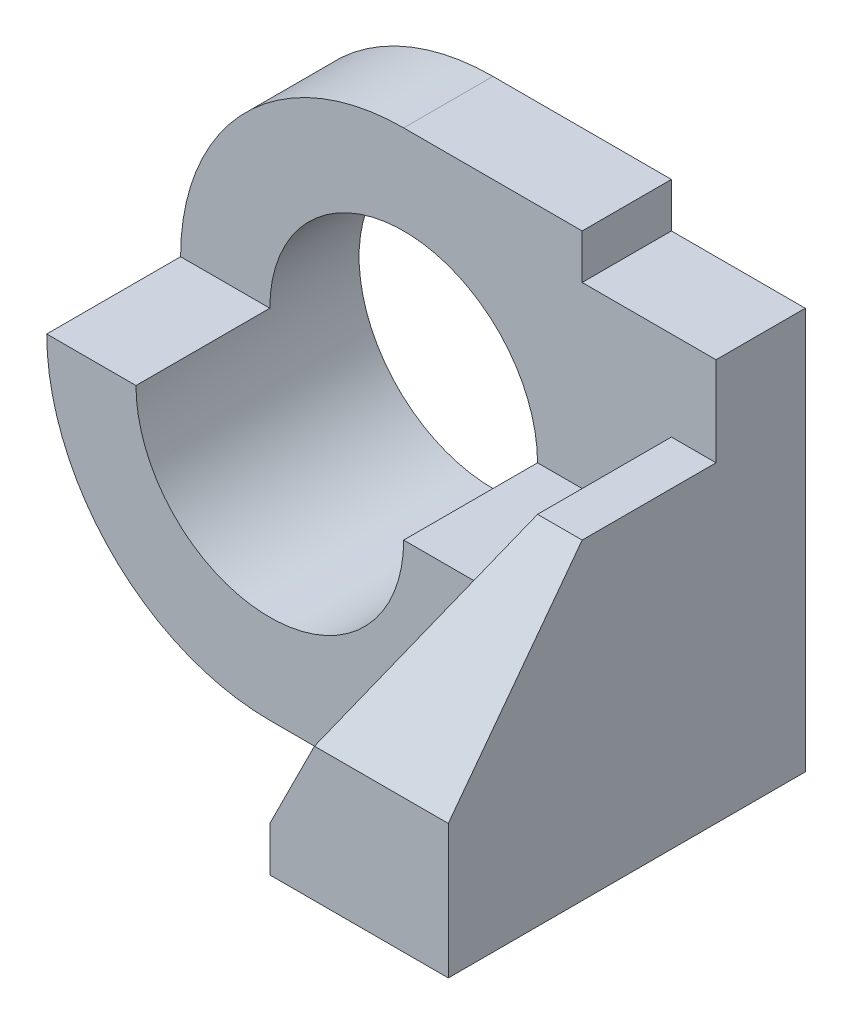
ISO-10303-21;
HEADER;
FILE_DESCRIPTION(('STEP AP214'),'2;1');
FILE_NAME('part.step','',(''),(''),'','','');
FILE_SCHEMA(('AUTOMOTIVE_DESIGN { 1 0 10303 214 1 1 1 1 }'));
ENDSEC;
DATA;
#1=APPLICATION_CONTEXT('core data for automotive mechanical design processes');
#2=APPLICATION_PROTOCOL_DEFINITION('international standard','automotive_design',2000,#1);
#3=PRODUCT_CONTEXT('',#1,'mechanical');
#4=PRODUCT('Part','Part','',(#3));
#5=PRODUCT_RELATED_PRODUCT_CATEGORY('part','',(#4));
#6=PRODUCT_DEFINITION_FORMATION('','',#4);
#7=PRODUCT_DEFINITION_CONTEXT('part definition',#1,'design');
#8=PRODUCT_DEFINITION('design','',#6,#7);
#9=PRODUCT_DEFINITION_SHAPE('','',#8);
#10=(LENGTH_UNIT() NAMED_UNIT(*) SI_UNIT(.MILLI.,.METRE.));
#11=(NAMED_UNIT(*) PLANE_ANGLE_UNIT() SI_UNIT($,.RADIAN.));
#12=(NAMED_UNIT(*) SI_UNIT($,.STERADIAN.) SOLID_ANGLE_UNIT());
#13=UNCERTAINTY_MEASURE_WITH_UNIT(LENGTH_MEASURE(1.E-05),#10,'distance_accuracy_value','');
#14=(GEOMETRIC_REPRESENTATION_CONTEXT(3) GLOBAL_UNCERTAINTY_ASSIGNED_CONTEXT((#13)) GLOBAL_UNIT_ASSIGNED_CONTEXT((#10,
#11,#12)) REPRESENTATION_CONTEXT('',''));
#15=CARTESIAN_POINT('',(0.,0.,0.));
#16=DIRECTION('',(0.,0.,1.));
#17=DIRECTION('',(1.,0.,0.));
#18=AXIS2_PLACEMENT_3D('',#15,#16,#17);
#19=CARTESIAN_POINT('',(0.,5.,5.));
#20=DIRECTION('',(0.,0.,1.));
#21=DIRECTION('',(1.,0.,0.));
#22=AXIS2_PLACEMENT_3D('',#19,#20,#21);
#23=PLANE('',#22);
#24=DIRECTION('',(0.,1.,0.));
#25=VECTOR('',#24,1.);
#26=CARTESIAN_POINT('',(3.,5.,5.));
#27=LINE('',#26,#25);
#28=CARTESIAN_POINT('',(3.,0.,5.));
#29=VERTEX_POINT('',#28);
#30=CARTESIAN_POINT('',(3.,1.,5.));
#31=VERTEX_POINT('',#30);
#32=EDGE_CURVE('E185',#29,#31,#27,.T.);
#33=ORIENTED_EDGE('',*,*,#32,.T.);
#34=DIRECTION('',(0.447213595499958,0.894427190999916,0.));
#35=VECTOR('',#34,1.);
#36=CARTESIAN_POINT('',(4.,3.,5.));
#37=LINE('',#36,#35);
#38=CARTESIAN_POINT('',(5.,5.,5.));
#39=VERTEX_POINT('',#38);
#40=EDGE_CURVE('E158',#31,#39,#37,.T.);
#41=ORIENTED_EDGE('',*,*,#40,.T.);
#42=DIRECTION('',(1.,0.,0.));
#43=VECTOR('',#42,1.);
#44=CARTESIAN_POINT('',(-5.,5.,5.));
#45=LINE('',#44,#43);
#46=CARTESIAN_POINT('',(3.,5.,5.));
#47=VERTEX_POINT('',#46);
#48=EDGE_CURVE('E187',#47,#39,#45,.T.);
#49=ORIENTED_EDGE('',*,*,#48,.F.);
#50=CARTESIAN_POINT('',(0.,5.,5.));
#51=DIRECTION('',(0.,0.,1.));
#52=DIRECTION('',(1.,0.,0.));
#53=AXIS2_PLACEMENT_3D('',#50,#51,#52);
#54=CIRCLE('',#53,3.);
#55=CARTESIAN_POINT('',(-3.,5.,5.));
#56=VERTEX_POINT('',#55);
#57=EDGE_CURVE('E211',#56,#47,#54,.T.);
#58=ORIENTED_EDGE('',*,*,#57,.F.);
#59=CARTESIAN_POINT('',(-5.,5.,5.));
#60=VERTEX_POINT('',#59);
#61=EDGE_CURVE('E192',#60,#56,#45,.T.);
#62=ORIENTED_EDGE('',*,*,#61,.F.);
#63=CARTESIAN_POINT('',(0.,5.,5.));
#64=DIRECTION('',(0.,0.,1.));
#65=DIRECTION('',(1.,0.,0.));
#66=AXIS2_PLACEMENT_3D('',#63,#64,#65);
#67=CIRCLE('',#66,5.);
#68=CARTESIAN_POINT('',(0.,0.,5.));
#69=VERTEX_POINT('',#68);
#70=EDGE_CURVE('E217',#60,#69,#67,.T.);
#71=ORIENTED_EDGE('',*,*,#70,.T.);
#72=DIRECTION('',(1.,0.,0.));
#73=VECTOR('',#72,1.);
#74=CARTESIAN_POINT('',(0.,0.,5.));
#75=LINE('',#74,#73);
#76=EDGE_CURVE('E219',#69,#29,#75,.T.);
#77=ORIENTED_EDGE('',*,*,#76,.T.);
#78=EDGE_LOOP('',(#33,#41,#49,#58,#62,#71,#77));
#79=FACE_BOUND('',#78,.T.);
#80=ADVANCED_FACE('F37',(#79),#23,.T.);
#81=CARTESIAN_POINT('',(-5.,5.,2.));
#82=DIRECTION('',(0.,-1.,0.));
#83=DIRECTION('',(0.,0.,-1.));
#84=AXIS2_PLACEMENT_3D('',#81,#82,#83);
#85=PLANE('',#84);
#86=DIRECTION('',(0.,0.,1.));
#87=VECTOR('',#86,1.);
#88=CARTESIAN_POINT('',(5.,5.,2.));
#89=LINE('',#88,#87);
#90=CARTESIAN_POINT('',(5.,5.,2.));
#91=VERTEX_POINT('',#90);
#92=EDGE_CURVE('E182',#91,#39,#89,.T.);
#93=ORIENTED_EDGE('',*,*,#92,.F.);
#94=DIRECTION('',(1.,0.,0.));
#95=VECTOR('',#94,1.);
#96=CARTESIAN_POINT('',(-5.,5.,2.));
#97=LINE('',#96,#95);
#98=CARTESIAN_POINT('',(3.,5.,2.));
#99=VERTEX_POINT('',#98);
#100=EDGE_CURVE('E191',#99,#91,#97,.T.);
#101=ORIENTED_EDGE('',*,*,#100,.F.);
#102=DIRECTION('',(0.,0.,-1.));
#103=VECTOR('',#102,1.);
#104=CARTESIAN_POINT('',(3.,5.,5.));
#105=LINE('',#104,#103);
#106=EDGE_CURVE('E253',#99,#47,#105,.F.);
#107=ORIENTED_EDGE('',*,*,#106,.T.);
#108=ORIENTED_EDGE('',*,*,#48,.T.);
#109=EDGE_LOOP('',(#93,#101,#107,#108));
#110=FACE_BOUND('',#109,.T.);
#111=ADVANCED_FACE('F278',(#110),#85,.F.);
#112=CARTESIAN_POINT('',(0.,0.,2.));
#113=DIRECTION('',(0.,0.,-1.));
#114=DIRECTION('',(-1.,0.,0.));
#115=AXIS2_PLACEMENT_3D('',#112,#113,#114);
#116=PLANE('',#115);
#117=DIRECTION('',(-1.,0.,0.));
#118=VECTOR('',#117,1.);
#119=CARTESIAN_POINT('',(7.,7.,2.));
#120=LINE('',#119,#118);
#121=CARTESIAN_POINT('',(7.,7.,2.));
#122=VERTEX_POINT('',#121);
#123=CARTESIAN_POINT('',(6.,7.,2.));
#124=VERTEX_POINT('',#123);
#125=EDGE_CURVE('E172',#122,#124,#120,.T.);
#126=ORIENTED_EDGE('',*,*,#125,.F.);
#127=DIRECTION('',(0.,-1.,0.));
#128=VECTOR('',#127,1.);
#129=CARTESIAN_POINT('',(7.,0.,2.));
#130=LINE('',#129,#128);
#131=CARTESIAN_POINT('',(7.,9.,2.));
#132=VERTEX_POINT('',#131);
#133=EDGE_CURVE('E204',#132,#122,#130,.T.);
#134=ORIENTED_EDGE('',*,*,#133,.F.);
#135=DIRECTION('',(1.,0.,0.));
#136=VECTOR('',#135,1.);
#137=CARTESIAN_POINT('',(7.,9.,2.));
#138=LINE('',#137,#136);
#139=CARTESIAN_POINT('',(4.,9.,2.));
#140=VERTEX_POINT('',#139);
#141=EDGE_CURVE('E201',#140,#132,#138,.T.);
#142=ORIENTED_EDGE('',*,*,#141,.F.);
#143=DIRECTION('',(0.,-1.,0.));
#144=VECTOR('',#143,1.);
#145=CARTESIAN_POINT('',(4.,9.,2.));
#146=LINE('',#145,#144);
#147=CARTESIAN_POINT('',(4.,10.,2.));
#148=VERTEX_POINT('',#147);
#149=EDGE_CURVE('E198',#148,#140,#146,.T.);
#150=ORIENTED_EDGE('',*,*,#149,.F.);
#151=DIRECTION('',(1.,0.,0.));
#152=VECTOR('',#151,1.);
#153=CARTESIAN_POINT('',(4.,10.,2.));
#154=LINE('',#153,#152);
#155=CARTESIAN_POINT('',(0.,10.,2.));
#156=VERTEX_POINT('',#155);
#157=EDGE_CURVE('E195',#156,#148,#154,.T.);
#158=ORIENTED_EDGE('',*,*,#157,.F.);
#159=CARTESIAN_POINT('',(0.,5.,2.));
#160=DIRECTION('',(0.,0.,-1.));
#161=DIRECTION('',(-1.,0.,0.));
#162=AXIS2_PLACEMENT_3D('',#159,#160,#161);
#163=CIRCLE('',#162,5.);
#164=CARTESIAN_POINT('',(-5.,5.,2.));
#165=VERTEX_POINT('',#164);
#166=EDGE_CURVE('E207',#165,#156,#163,.T.);
#167=ORIENTED_EDGE('',*,*,#166,.F.);
#168=CARTESIAN_POINT('',(-3.,5.,2.));
#169=VERTEX_POINT('',#168);
#170=EDGE_CURVE('E188',#165,#169,#97,.T.);
#171=ORIENTED_EDGE('',*,*,#170,.T.);
#172=CARTESIAN_POINT('',(0.,5.,2.));
#173=DIRECTION('',(0.,0.,-1.));
#174=DIRECTION('',(-1.,0.,0.));
#175=AXIS2_PLACEMENT_3D('',#172,#173,#174);
#176=CIRCLE('',#175,3.);
#177=EDGE_CURVE('E251',#169,#99,#176,.T.);
#178=ORIENTED_EDGE('',*,*,#177,.T.);
#179=ORIENTED_EDGE('',*,*,#100,.T.);
#180=DIRECTION('',(-0.447213595499958,-0.894427190999916,0.));
#181=VECTOR('',#180,1.);
#182=CARTESIAN_POINT('',(6.,7.,2.));
#183=LINE('',#182,#181);
#184=EDGE_CURVE('E175',#124,#91,#183,.T.);
#185=ORIENTED_EDGE('',*,*,#184,.F.);
#186=EDGE_LOOP('',(#126,#134,#142,#150,#158,#167,#171,#178,#179,#185));
#187=FACE_BOUND('',#186,.T.);
#188=ADVANCED_FACE('F274',(#187),#116,.F.);
#189=CARTESIAN_POINT('',(0.,5.,0.));
#190=DIRECTION('',(0.,0.,1.));
#191=DIRECTION('',(1.,0.,0.));
#192=AXIS2_PLACEMENT_3D('',#189,#190,#191);
#193=PLANE('',#192);
#194=CARTESIAN_POINT('',(0.,5.,0.));
#195=DIRECTION('',(0.,0.,1.));
#196=DIRECTION('',(1.,0.,0.));
#197=AXIS2_PLACEMENT_3D('',#194,#195,#196);
#198=CIRCLE('',#197,5.);
#199=CARTESIAN_POINT('',(0.,10.,0.));
#200=VERTEX_POINT('',#199);
#201=CARTESIAN_POINT('',(0.,0.,0.));
#202=VERTEX_POINT('',#201);
#203=EDGE_CURVE('E214',#200,#202,#198,.T.);
#204=ORIENTED_EDGE('',*,*,#203,.F.);
#205=DIRECTION('',(-1.,0.,0.));
#206=VECTOR('',#205,1.);
#207=CARTESIAN_POINT('',(4.,10.,0.));
#208=LINE('',#207,#206);
#209=CARTESIAN_POINT('',(4.,10.,0.));
#210=VERTEX_POINT('',#209);
#211=EDGE_CURVE('E220',#210,#200,#208,.T.);
#212=ORIENTED_EDGE('',*,*,#211,.F.);
#213=DIRECTION('',(0.,1.,0.));
#214=VECTOR('',#213,1.);
#215=CARTESIAN_POINT('',(4.,9.,0.));
#216=LINE('',#215,#214);
#217=CARTESIAN_POINT('',(4.,9.,0.));
#218=VERTEX_POINT('',#217);
#219=EDGE_CURVE('E234',#218,#210,#216,.T.);
#220=ORIENTED_EDGE('',*,*,#219,.F.);
#221=DIRECTION('',(-1.,0.,0.));
#222=VECTOR('',#221,1.);
#223=CARTESIAN_POINT('',(7.,9.,0.));
#224=LINE('',#223,#222);
#225=CARTESIAN_POINT('',(7.,9.,0.));
#226=VERTEX_POINT('',#225);
#227=EDGE_CURVE('E231',#226,#218,#224,.T.);
#228=ORIENTED_EDGE('',*,*,#227,.F.);
#229=DIRECTION('',(0.,1.,0.));
#230=VECTOR('',#229,1.);
#231=CARTESIAN_POINT('',(7.,0.,0.));
#232=LINE('',#231,#230);
#233=CARTESIAN_POINT('',(7.,0.,0.));
#234=VERTEX_POINT('',#233);
#235=EDGE_CURVE('E228',#234,#226,#232,.T.);
#236=ORIENTED_EDGE('',*,*,#235,.F.);
#237=DIRECTION('',(1.,0.,0.));
#238=VECTOR('',#237,1.);
#239=CARTESIAN_POINT('',(0.,0.,0.));
#240=LINE('',#239,#238);
#241=EDGE_CURVE('E225',#202,#234,#240,.T.);
#242=ORIENTED_EDGE('',*,*,#241,.F.);
#243=EDGE_LOOP('',(#204,#212,#220,#228,#236,#242));
#244=FACE_BOUND('',#243,.T.);
#245=CARTESIAN_POINT('',(0.,5.,0.));
#246=DIRECTION('',(0.,0.,1.));
#247=DIRECTION('',(1.,0.,0.));
#248=AXIS2_PLACEMENT_3D('',#245,#246,#247);
#249=CIRCLE('',#248,3.);
#250=CARTESIAN_POINT('',(3.,5.,0.));
#251=VERTEX_POINT('',#250);
#252=EDGE_CURVE('E210',#251,#251,#249,.T.);
#253=ORIENTED_EDGE('',*,*,#252,.T.);
#254=EDGE_LOOP('',(#253));
#255=FACE_BOUND('',#254,.T.);
#256=ADVANCED_FACE('F302',(#244,#255),#193,.F.);
#257=CARTESIAN_POINT('',(0.,5.,5.));
#258=DIRECTION('',(0.,0.,-1.));
#259=DIRECTION('',(-1.,0.,0.));
#260=AXIS2_PLACEMENT_3D('',#257,#258,#259);
#261=CYLINDRICAL_SURFACE('',#260,5.);
#262=ORIENTED_EDGE('',*,*,#70,.F.);
#263=DIRECTION('',(0.,0.,1.));
#264=VECTOR('',#263,1.);
#265=CARTESIAN_POINT('',(-5.,5.,2.));
#266=LINE('',#265,#264);
#267=EDGE_CURVE('E190',#165,#60,#266,.T.);
#268=ORIENTED_EDGE('',*,*,#267,.F.);
#269=ORIENTED_EDGE('',*,*,#166,.T.);
#270=DIRECTION('',(0.,0.,-1.));
#271=VECTOR('',#270,1.);
#272=CARTESIAN_POINT('',(0.,10.,5.));
#273=LINE('',#272,#271);
#274=EDGE_CURVE('E222',#156,#200,#273,.T.);
#275=ORIENTED_EDGE('',*,*,#274,.T.);
#276=ORIENTED_EDGE('',*,*,#203,.T.);
#277=DIRECTION('',(0.,0.,-1.));
#278=VECTOR('',#277,1.);
#279=CARTESIAN_POINT('',(0.,0.,5.));
#280=LINE('',#279,#278);
#281=EDGE_CURVE('E248',#69,#202,#280,.T.);
#282=ORIENTED_EDGE('',*,*,#281,.F.);
#283=EDGE_LOOP('',(#262,#268,#269,#275,#276,#282));
#284=FACE_BOUND('',#283,.T.);
#285=ADVANCED_FACE('F305',(#284),#261,.T.);
#286=CARTESIAN_POINT('',(0.,0.,5.));
#287=DIRECTION('',(0.,1.,0.));
#288=DIRECTION('',(0.,0.,1.));
#289=AXIS2_PLACEMENT_3D('',#286,#287,#288);
#290=PLANE('',#289);
#291=DIRECTION('',(0.,0.,-1.));
#292=VECTOR('',#291,1.);
#293=CARTESIAN_POINT('',(7.,0.,5.));
#294=LINE('',#293,#292);
#295=CARTESIAN_POINT('',(7.,0.,8.));
#296=VERTEX_POINT('',#295);
#297=EDGE_CURVE('E246',#296,#234,#294,.T.);
#298=ORIENTED_EDGE('',*,*,#297,.F.);
#299=DIRECTION('',(1.,0.,0.));
#300=VECTOR('',#299,1.);
#301=CARTESIAN_POINT('',(3.,0.,8.));
#302=LINE('',#301,#300);
#303=CARTESIAN_POINT('',(3.,0.,8.));
#304=VERTEX_POINT('',#303);
#305=EDGE_CURVE('E167',#304,#296,#302,.T.);
#306=ORIENTED_EDGE('',*,*,#305,.F.);
#307=DIRECTION('',(0.,0.,-1.));
#308=VECTOR('',#307,1.);
#309=CARTESIAN_POINT('',(3.,0.,8.));
#310=LINE('',#309,#308);
#311=EDGE_CURVE('E162',#304,#29,#310,.T.);
#312=ORIENTED_EDGE('',*,*,#311,.T.);
#313=ORIENTED_EDGE('',*,*,#76,.F.);
#314=ORIENTED_EDGE('',*,*,#281,.T.);
#315=ORIENTED_EDGE('',*,*,#241,.T.);
#316=EDGE_LOOP('',(#298,#306,#312,#313,#314,#315));
#317=FACE_BOUND('',#316,.T.);
#318=ADVANCED_FACE('F321',(#317),#290,.F.);
#319=CARTESIAN_POINT('',(7.,0.,5.));
#320=DIRECTION('',(-1.,0.,0.));
#321=DIRECTION('',(0.,0.,1.));
#322=AXIS2_PLACEMENT_3D('',#319,#320,#321);
#323=PLANE('',#322);
#324=DIRECTION('',(0.,0.,-1.));
#325=VECTOR('',#324,1.);
#326=CARTESIAN_POINT('',(7.,7.,8.));
#327=LINE('',#326,#325);
#328=CARTESIAN_POINT('',(7.,7.,5.));
#329=VERTEX_POINT('',#328);
#330=EDGE_CURVE('E180',#329,#122,#327,.T.);
#331=ORIENTED_EDGE('',*,*,#330,.F.);
#332=DIRECTION('',(0.,-0.8,0.6));
#333=VECTOR('',#332,1.);
#334=CARTESIAN_POINT('',(7.,3.,8.));
#335=LINE('',#334,#333);
#336=CARTESIAN_POINT('',(7.,3.,8.));
#337=VERTEX_POINT('',#336);
#338=EDGE_CURVE('E13',#329,#337,#335,.T.);
#339=ORIENTED_EDGE('',*,*,#338,.T.);
#340=DIRECTION('',(0.,1.,0.));
#341=VECTOR('',#340,1.);
#342=CARTESIAN_POINT('',(7.,0.,8.));
#343=LINE('',#342,#341);
#344=EDGE_CURVE('E151',#296,#337,#343,.T.);
#345=ORIENTED_EDGE('',*,*,#344,.F.);
#346=ORIENTED_EDGE('',*,*,#297,.T.);
#347=ORIENTED_EDGE('',*,*,#235,.T.);
#348=DIRECTION('',(0.,0.,-1.));
#349=VECTOR('',#348,1.);
#350=CARTESIAN_POINT('',(7.,9.,5.));
#351=LINE('',#350,#349);
#352=EDGE_CURVE('E244',#132,#226,#351,.T.);
#353=ORIENTED_EDGE('',*,*,#352,.F.);
#354=ORIENTED_EDGE('',*,*,#133,.T.);
#355=EDGE_LOOP('',(#331,#339,#345,#346,#347,#353,#354));
#356=FACE_BOUND('',#355,.T.);
#357=ADVANCED_FACE('F284',(#356),#323,.F.);
#358=CARTESIAN_POINT('',(7.,9.,5.));
#359=DIRECTION('',(0.,-1.,0.));
#360=DIRECTION('',(0.,0.,-1.));
#361=AXIS2_PLACEMENT_3D('',#358,#359,#360);
#362=PLANE('',#361);
#363=DIRECTION('',(0.,0.,-1.));
#364=VECTOR('',#363,1.);
#365=CARTESIAN_POINT('',(4.,9.,5.));
#366=LINE('',#365,#364);
#367=EDGE_CURVE('E242',#140,#218,#366,.T.);
#368=ORIENTED_EDGE('',*,*,#367,.F.);
#369=ORIENTED_EDGE('',*,*,#141,.T.);
#370=ORIENTED_EDGE('',*,*,#352,.T.);
#371=ORIENTED_EDGE('',*,*,#227,.T.);
#372=EDGE_LOOP('',(#368,#369,#370,#371));
#373=FACE_BOUND('',#372,.T.);
#374=ADVANCED_FACE('F314',(#373),#362,.F.);
#375=CARTESIAN_POINT('',(4.,9.,5.));
#376=DIRECTION('',(-1.,0.,0.));
#377=DIRECTION('',(0.,0.,1.));
#378=AXIS2_PLACEMENT_3D('',#375,#376,#377);
#379=PLANE('',#378);
#380=DIRECTION('',(0.,0.,-1.));
#381=VECTOR('',#380,1.);
#382=CARTESIAN_POINT('',(4.,10.,5.));
#383=LINE('',#382,#381);
#384=EDGE_CURVE('E240',#148,#210,#383,.T.);
#385=ORIENTED_EDGE('',*,*,#384,.F.);
#386=ORIENTED_EDGE('',*,*,#149,.T.);
#387=ORIENTED_EDGE('',*,*,#367,.T.);
#388=ORIENTED_EDGE('',*,*,#219,.T.);
#389=EDGE_LOOP('',(#385,#386,#387,#388));
#390=FACE_BOUND('',#389,.T.);
#391=ADVANCED_FACE('F310',(#390),#379,.F.);
#392=CARTESIAN_POINT('',(4.,10.,5.));
#393=DIRECTION('',(0.,-1.,0.));
#394=DIRECTION('',(0.,0.,-1.));
#395=AXIS2_PLACEMENT_3D('',#392,#393,#394);
#396=PLANE('',#395);
#397=ORIENTED_EDGE('',*,*,#274,.F.);
#398=ORIENTED_EDGE('',*,*,#157,.T.);
#399=ORIENTED_EDGE('',*,*,#384,.T.);
#400=ORIENTED_EDGE('',*,*,#211,.T.);
#401=EDGE_LOOP('',(#397,#398,#399,#400));
#402=FACE_BOUND('',#401,.T.);
#403=ADVANCED_FACE('F307',(#402),#396,.F.);
#404=CARTESIAN_POINT('',(0.,5.,5.));
#405=DIRECTION('',(0.,0.,-1.));
#406=DIRECTION('',(-1.,0.,0.));
#407=AXIS2_PLACEMENT_3D('',#404,#405,#406);
#408=CYLINDRICAL_SURFACE('',#407,3.);
#409=DIRECTION('',(0.,0.,-1.));
#410=VECTOR('',#409,1.);
#411=CARTESIAN_POINT('',(-3.,5.,5.));
#412=LINE('',#411,#410);
#413=EDGE_CURVE('E255',#56,#169,#412,.T.);
#414=ORIENTED_EDGE('',*,*,#413,.F.);
#415=ORIENTED_EDGE('',*,*,#57,.T.);
#416=ORIENTED_EDGE('',*,*,#106,.F.);
#417=ORIENTED_EDGE('',*,*,#177,.F.);
#418=EDGE_LOOP('',(#414,#415,#416,#417));
#419=FACE_BOUND('',#418,.T.);
#420=ORIENTED_EDGE('',*,*,#252,.F.);
#421=EDGE_LOOP('',(#420));
#422=FACE_BOUND('',#421,.T.);
#423=ADVANCED_FACE('F269',(#419,#422),#408,.F.);
#424=ORIENTED_EDGE('',*,*,#413,.T.);
#425=ORIENTED_EDGE('',*,*,#170,.F.);
#426=ORIENTED_EDGE('',*,*,#267,.T.);
#427=ORIENTED_EDGE('',*,*,#61,.T.);
#428=EDGE_LOOP('',(#424,#425,#426,#427));
#429=FACE_BOUND('',#428,.T.);
#430=ADVANCED_FACE('F263',(#429),#85,.F.);
#431=CARTESIAN_POINT('',(7.,7.,8.));
#432=DIRECTION('',(0.,-1.,0.));
#433=DIRECTION('',(0.,0.,-1.));
#434=AXIS2_PLACEMENT_3D('',#431,#432,#433);
#435=PLANE('',#434);
#436=DIRECTION('',(0.,0.,-1.));
#437=VECTOR('',#436,1.);
#438=CARTESIAN_POINT('',(6.,7.,8.));
#439=LINE('',#438,#437);
#440=CARTESIAN_POINT('',(6.,7.,5.));
#441=VERTEX_POINT('',#440);
#442=EDGE_CURVE('E161',#441,#124,#439,.T.);
#443=ORIENTED_EDGE('',*,*,#442,.F.);
#444=DIRECTION('',(1.,0.,0.));
#445=VECTOR('',#444,1.);
#446=CARTESIAN_POINT('',(7.,7.,5.));
#447=LINE('',#446,#445);
#448=EDGE_CURVE('E45',#441,#329,#447,.T.);
#449=ORIENTED_EDGE('',*,*,#448,.T.);
#450=ORIENTED_EDGE('',*,*,#330,.T.);
#451=ORIENTED_EDGE('',*,*,#125,.T.);
#452=EDGE_LOOP('',(#443,#449,#450,#451));
#453=FACE_BOUND('',#452,.T.);
#454=ADVANCED_FACE('F281',(#453),#435,.F.);
#455=CARTESIAN_POINT('',(6.,7.,8.));
#456=DIRECTION('',(0.894427190999916,-0.447213595499958,0.));
#457=DIRECTION('',(0.447213595499958,0.894427190999916,0.));
#458=AXIS2_PLACEMENT_3D('',#455,#456,#457);
#459=PLANE('',#458);
#460=DIRECTION('',(-0.447213595499958,-0.894427190999916,0.));
#461=VECTOR('',#460,1.);
#462=CARTESIAN_POINT('',(6.,7.,8.));
#463=LINE('',#462,#461);
#464=CARTESIAN_POINT('',(4.,3.,8.));
#465=VERTEX_POINT('',#464);
#466=CARTESIAN_POINT('',(3.,1.,8.));
#467=VERTEX_POINT('',#466);
#468=EDGE_CURVE('E141',#465,#467,#463,.T.);
#469=ORIENTED_EDGE('',*,*,#468,.F.);
#470=DIRECTION('',(0.371390676354104,0.742781352708207,-0.557086014531155));
#471=VECTOR('',#470,1.);
#472=CARTESIAN_POINT('',(3.44827586206897,1.89655172413793,8.82758620689655));
#473=LINE('',#472,#471);
#474=EDGE_CURVE('E59',#465,#441,#473,.T.);
#475=ORIENTED_EDGE('',*,*,#474,.T.);
#476=ORIENTED_EDGE('',*,*,#442,.T.);
#477=ORIENTED_EDGE('',*,*,#184,.T.);
#478=ORIENTED_EDGE('',*,*,#92,.T.);
#479=ORIENTED_EDGE('',*,*,#40,.F.);
#480=DIRECTION('',(0.,0.,-1.));
#481=VECTOR('',#480,1.);
#482=CARTESIAN_POINT('',(3.,1.,8.));
#483=LINE('',#482,#481);
#484=EDGE_CURVE('E155',#467,#31,#483,.T.);
#485=ORIENTED_EDGE('',*,*,#484,.F.);
#486=EDGE_LOOP('',(#469,#475,#476,#477,#478,#479,#485));
#487=FACE_BOUND('',#486,.T.);
#488=ADVANCED_FACE('F156',(#487),#459,.F.);
#489=CARTESIAN_POINT('',(3.,1.,8.));
#490=DIRECTION('',(1.,0.,0.));
#491=DIRECTION('',(0.,0.,-1.));
#492=AXIS2_PLACEMENT_3D('',#489,#490,#491);
#493=PLANE('',#492);
#494=ORIENTED_EDGE('',*,*,#32,.F.);
#495=ORIENTED_EDGE('',*,*,#311,.F.);
#496=DIRECTION('',(0.,-1.,0.));
#497=VECTOR('',#496,1.);
#498=CARTESIAN_POINT('',(3.,1.,8.));
#499=LINE('',#498,#497);
#500=EDGE_CURVE('E147',#467,#304,#499,.T.);
#501=ORIENTED_EDGE('',*,*,#500,.F.);
#502=ORIENTED_EDGE('',*,*,#484,.T.);
#503=EDGE_LOOP('',(#494,#495,#501,#502));
#504=FACE_BOUND('',#503,.T.);
#505=ADVANCED_FACE('F164',(#504),#493,.F.);
#506=CARTESIAN_POINT('',(0.,0.,8.));
#507=DIRECTION('',(0.,0.,1.));
#508=DIRECTION('',(1.,0.,0.));
#509=AXIS2_PLACEMENT_3D('',#506,#507,#508);
#510=PLANE('',#509);
#511=ORIENTED_EDGE('',*,*,#344,.T.);
#512=DIRECTION('',(-1.,0.,0.));
#513=VECTOR('',#512,1.);
#514=CARTESIAN_POINT('',(6.,3.,8.));
#515=LINE('',#514,#513);
#516=EDGE_CURVE('E150',#337,#465,#515,.T.);
#517=ORIENTED_EDGE('',*,*,#516,.T.);
#518=ORIENTED_EDGE('',*,*,#468,.T.);
#519=ORIENTED_EDGE('',*,*,#500,.T.);
#520=ORIENTED_EDGE('',*,*,#305,.T.);
#521=EDGE_LOOP('',(#511,#517,#518,#519,#520));
#522=FACE_BOUND('',#521,.T.);
#523=ADVANCED_FACE('F144',(#522),#510,.T.);
#524=CARTESIAN_POINT('',(0.,3.,8.));
#525=DIRECTION('',(0.,0.6,0.8));
#526=DIRECTION('',(1.,0.,0.));
#527=AXIS2_PLACEMENT_3D('',#524,#525,#526);
#528=PLANE('',#527);
#529=ORIENTED_EDGE('',*,*,#338,.F.);
#530=ORIENTED_EDGE('',*,*,#448,.F.);
#531=ORIENTED_EDGE('',*,*,#474,.F.);
#532=ORIENTED_EDGE('',*,*,#516,.F.);
#533=EDGE_LOOP('',(#529,#530,#531,#532));
#534=FACE_BOUND('',#533,.T.);
#535=ADVANCED_FACE('F39',(#534),#528,.T.);
#536=CLOSED_SHELL('',(#80,#111,#188,#256,#285,#318,#357,#374,#391,#403,#423,#430,#454,#488,#505,
#523,#535));
#537=MANIFOLD_SOLID_BREP('B2',#536);
#538=ADVANCED_BREP_SHAPE_REPRESENTATION('',(#18,#537),#14);
#539=SHAPE_DEFINITION_REPRESENTATION(#9,#538);
ENDSEC;
END-ISO-10303-21;
